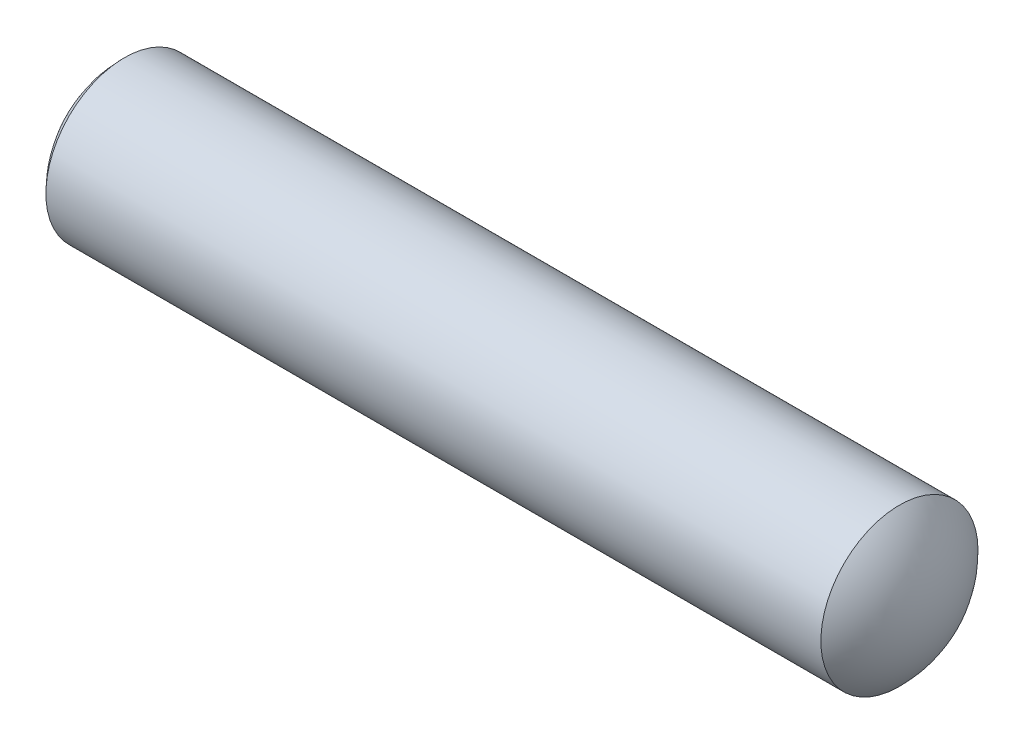
ISO-10303-21;
HEADER;
FILE_DESCRIPTION(('STEP AP214'),'2;1');
FILE_NAME('part.step','',(''),(''),'','','');
FILE_SCHEMA(('AUTOMOTIVE_DESIGN { 1 0 10303 214 1 1 1 1 }'));
ENDSEC;
DATA;
#1=APPLICATION_CONTEXT('core data for automotive mechanical design processes');
#2=APPLICATION_PROTOCOL_DEFINITION('international standard','automotive_design',2000,#1);
#3=PRODUCT_CONTEXT('',#1,'mechanical');
#4=PRODUCT('Part','Part','',(#3));
#5=PRODUCT_RELATED_PRODUCT_CATEGORY('part','',(#4));
#6=PRODUCT_DEFINITION_FORMATION('','',#4);
#7=PRODUCT_DEFINITION_CONTEXT('part definition',#1,'design');
#8=PRODUCT_DEFINITION('design','',#6,#7);
#9=PRODUCT_DEFINITION_SHAPE('','',#8);
#10=(LENGTH_UNIT() NAMED_UNIT(*) SI_UNIT(.MILLI.,.METRE.));
#11=(NAMED_UNIT(*) PLANE_ANGLE_UNIT() SI_UNIT($,.RADIAN.));
#12=(NAMED_UNIT(*) SI_UNIT($,.STERADIAN.) SOLID_ANGLE_UNIT());
#13=UNCERTAINTY_MEASURE_WITH_UNIT(LENGTH_MEASURE(1.E-05),#10,'distance_accuracy_value','');
#14=(GEOMETRIC_REPRESENTATION_CONTEXT(3) GLOBAL_UNCERTAINTY_ASSIGNED_CONTEXT((#13)) GLOBAL_UNIT_ASSIGNED_CONTEXT((#10,
#11,#12)) REPRESENTATION_CONTEXT('',''));
#15=CARTESIAN_POINT('',(0.,0.,0.));
#16=DIRECTION('',(0.,0.,1.));
#17=DIRECTION('',(1.,0.,0.));
#18=AXIS2_PLACEMENT_3D('',#15,#16,#17);
#19=CARTESIAN_POINT('',(15.1875,-20.449194000159,-6.00442511768297));
#20=DIRECTION('',(0.,0.281732556841429,-0.959492973614498));
#21=DIRECTION('',(1.,0.,0.));
#22=AXIS2_PLACEMENT_3D('',#19,#20,#21);
#23=SPHERICAL_SURFACE('',#22,1.8375);
#24=CARTESIAN_POINT('',(15.1875,-20.449194000159,-6.00442511768297));
#25=DIRECTION('',(-1.,0.,0.));
#26=DIRECTION('',(0.,0.959492973614498,0.281732556841429));
#27=AXIS2_PLACEMENT_3D('',#24,#25,#26);
#28=SPHERICAL_SURFACE('',#27,1.8375);
#29=CARTESIAN_POINT('',(16.4734821149612,-20.449194000159,-6.00442511768297));
#30=DIRECTION('',(-1.,0.,0.));
#31=DIRECTION('',(0.,0.959492973614498,0.281732556841429));
#32=AXIS2_PLACEMENT_3D('',#29,#30,#31);
#33=CIRCLE('',#32,1.3125);
#34=CARTESIAN_POINT('',(16.4734821149612,-19.18985947229,-5.63465113682859));
#35=VERTEX_POINT('',#34);
#36=EDGE_CURVE('E11',#35,#35,#33,.T.);
#37=ORIENTED_EDGE('',*,*,#36,.F.);
#38=EDGE_LOOP('',(#37));
#39=FACE_BOUND('',#38,.T.);
#40=ADVANCED_FACE('F17',(#39),#28,.T.);
#41=CARTESIAN_POINT('',(10.,-20.449194000159,-6.00442511768296));
#42=DIRECTION('',(-1.,0.,0.));
#43=DIRECTION('',(0.,0.959492973614498,0.281732556841429));
#44=AXIS2_PLACEMENT_3D('',#41,#42,#43);
#45=CYLINDRICAL_SURFACE('',#44,1.3125);
#46=CARTESIAN_POINT('',(3.52651788503884,-20.449194000159,-6.00442511768296));
#47=DIRECTION('',(-1.,0.,0.));
#48=DIRECTION('',(0.,0.959492973614498,0.281732556841429));
#49=AXIS2_PLACEMENT_3D('',#46,#47,#48);
#50=CIRCLE('',#49,1.3125);
#51=CARTESIAN_POINT('',(3.52651788503884,-19.18985947229,-5.63465113682858));
#52=VERTEX_POINT('',#51);
#53=EDGE_CURVE('E26',#52,#52,#50,.T.);
#54=ORIENTED_EDGE('',*,*,#53,.F.);
#55=EDGE_LOOP('',(#54));
#56=FACE_BOUND('',#55,.T.);
#57=ORIENTED_EDGE('',*,*,#36,.T.);
#58=EDGE_LOOP('',(#57));
#59=FACE_BOUND('',#58,.T.);
#60=ADVANCED_FACE('F51',(#56,#59),#45,.T.);
#61=CARTESIAN_POINT('',(4.8125,-20.449194000159,-6.00442511768296));
#62=DIRECTION('',(0.,0.281732556841429,-0.959492973614498));
#63=DIRECTION('',(-1.,0.,0.));
#64=AXIS2_PLACEMENT_3D('',#61,#62,#63);
#65=SPHERICAL_SURFACE('',#64,1.8375);
#66=CARTESIAN_POINT('',(4.8125,-20.449194000159,-6.00442511768296));
#67=DIRECTION('',(-1.,0.,0.));
#68=DIRECTION('',(0.,0.959492973614498,0.281732556841429));
#69=AXIS2_PLACEMENT_3D('',#66,#67,#68);
#70=SPHERICAL_SURFACE('',#69,1.8375);
#71=ORIENTED_EDGE('',*,*,#53,.T.);
#72=EDGE_LOOP('',(#71));
#73=FACE_BOUND('',#72,.T.);
#74=ADVANCED_FACE('F19',(#73),#70,.T.);
#75=CLOSED_SHELL('',(#40,#60,#74));
#76=MANIFOLD_SOLID_BREP('B1',#75);
#77=ADVANCED_BREP_SHAPE_REPRESENTATION('',(#18,#76),#14);
#78=SHAPE_DEFINITION_REPRESENTATION(#9,#77);
ENDSEC;
END-ISO-10303-21;
